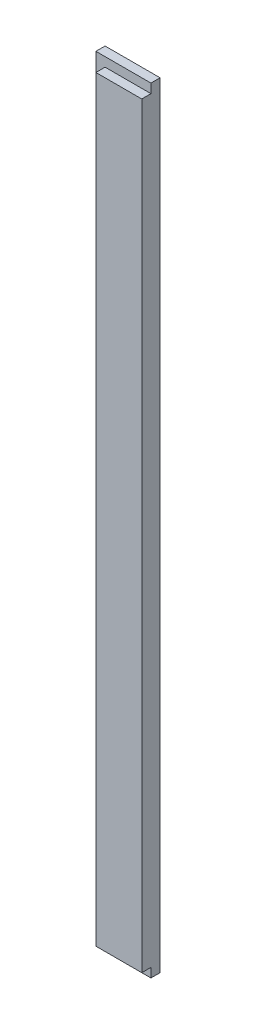
ISO-10303-21;
HEADER;
FILE_DESCRIPTION(('STEP AP214'),'2;1');
FILE_NAME('part.step','',(''),(''),'','','');
FILE_SCHEMA(('AUTOMOTIVE_DESIGN { 1 0 10303 214 1 1 1 1 }'));
ENDSEC;
DATA;
#1=APPLICATION_CONTEXT('core data for automotive mechanical design processes');
#2=APPLICATION_PROTOCOL_DEFINITION('international standard','automotive_design',2000,#1);
#3=PRODUCT_CONTEXT('',#1,'mechanical');
#4=PRODUCT('Part','Part','',(#3));
#5=PRODUCT_RELATED_PRODUCT_CATEGORY('part','',(#4));
#6=PRODUCT_DEFINITION_FORMATION('','',#4);
#7=PRODUCT_DEFINITION_CONTEXT('part definition',#1,'design');
#8=PRODUCT_DEFINITION('design','',#6,#7);
#9=PRODUCT_DEFINITION_SHAPE('','',#8);
#10=(LENGTH_UNIT() NAMED_UNIT(*) SI_UNIT(.MILLI.,.METRE.));
#11=(NAMED_UNIT(*) PLANE_ANGLE_UNIT() SI_UNIT($,.RADIAN.));
#12=(NAMED_UNIT(*) SI_UNIT($,.STERADIAN.) SOLID_ANGLE_UNIT());
#13=UNCERTAINTY_MEASURE_WITH_UNIT(LENGTH_MEASURE(1.E-05),#10,'distance_accuracy_value','');
#14=(GEOMETRIC_REPRESENTATION_CONTEXT(3) GLOBAL_UNCERTAINTY_ASSIGNED_CONTEXT((#13)) GLOBAL_UNIT_ASSIGNED_CONTEXT((#10,
#11,#12)) REPRESENTATION_CONTEXT('',''));
#15=CARTESIAN_POINT('',(0.,0.,0.));
#16=DIRECTION('',(0.,0.,1.));
#17=DIRECTION('',(1.,0.,0.));
#18=AXIS2_PLACEMENT_3D('',#15,#16,#17);
#19=CARTESIAN_POINT('',(-30.0000000000001,-422.5,20.));
#20=DIRECTION('',(1.,0.,0.));
#21=DIRECTION('',(0.,0.,-1.));
#22=AXIS2_PLACEMENT_3D('',#19,#20,#21);
#23=PLANE('',#22);
#24=DIRECTION('',(0.,-1.,0.));
#25=VECTOR('',#24,1.);
#26=CARTESIAN_POINT('',(-30.0000000000001,422.5,10.));
#27=LINE('',#26,#25);
#28=CARTESIAN_POINT('',(-30.0000000000001,422.5,10.));
#29=VERTEX_POINT('',#28);
#30=CARTESIAN_POINT('',(-30.0000000000001,-422.5,10.));
#31=VERTEX_POINT('',#30);
#32=EDGE_CURVE('E104',#29,#31,#27,.T.);
#33=ORIENTED_EDGE('',*,*,#32,.F.);
#34=DIRECTION('',(0.,0.,-1.));
#35=VECTOR('',#34,1.);
#36=CARTESIAN_POINT('',(-30.0000000000001,422.5,20.));
#37=LINE('',#36,#35);
#38=CARTESIAN_POINT('',(-30.0000000000001,422.5,0.));
#39=VERTEX_POINT('',#38);
#40=EDGE_CURVE('E59',#29,#39,#37,.T.);
#41=ORIENTED_EDGE('',*,*,#40,.T.);
#42=DIRECTION('',(0.,-1.,0.));
#43=VECTOR('',#42,1.);
#44=CARTESIAN_POINT('',(-30.0000000000001,-422.5,0.));
#45=LINE('',#44,#43);
#46=CARTESIAN_POINT('',(-30.0000000000001,-422.5,0.));
#47=VERTEX_POINT('',#46);
#48=EDGE_CURVE('E144',#39,#47,#45,.T.);
#49=ORIENTED_EDGE('',*,*,#48,.T.);
#50=DIRECTION('',(0.,0.,-1.));
#51=VECTOR('',#50,1.);
#52=CARTESIAN_POINT('',(-30.0000000000001,-422.5,20.));
#53=LINE('',#52,#51);
#54=EDGE_CURVE('E11',#31,#47,#53,.T.);
#55=ORIENTED_EDGE('',*,*,#54,.F.);
#56=EDGE_LOOP('',(#33,#41,#49,#55));
#57=FACE_BOUND('',#56,.T.);
#58=ADVANCED_FACE('F37',(#57),#23,.F.);
#59=CARTESIAN_POINT('',(30.0000000000001,-422.5,20.));
#60=DIRECTION('',(0.,1.,0.));
#61=DIRECTION('',(0.,0.,1.));
#62=AXIS2_PLACEMENT_3D('',#59,#60,#61);
#63=PLANE('',#62);
#64=DIRECTION('',(1.,0.,0.));
#65=VECTOR('',#64,1.);
#66=CARTESIAN_POINT('',(-30.0000000000001,-422.5,10.));
#67=LINE('',#66,#65);
#68=CARTESIAN_POINT('',(30.0000000000001,-422.5,10.));
#69=VERTEX_POINT('',#68);
#70=EDGE_CURVE('E114',#31,#69,#67,.T.);
#71=ORIENTED_EDGE('',*,*,#70,.F.);
#72=ORIENTED_EDGE('',*,*,#54,.T.);
#73=DIRECTION('',(1.,0.,0.));
#74=VECTOR('',#73,1.);
#75=CARTESIAN_POINT('',(30.0000000000001,-422.5,0.));
#76=LINE('',#75,#74);
#77=CARTESIAN_POINT('',(30.0000000000001,-422.5,0.));
#78=VERTEX_POINT('',#77);
#79=EDGE_CURVE('E141',#47,#78,#76,.T.);
#80=ORIENTED_EDGE('',*,*,#79,.T.);
#81=DIRECTION('',(0.,0.,-1.));
#82=VECTOR('',#81,1.);
#83=CARTESIAN_POINT('',(30.0000000000001,-422.5,20.));
#84=LINE('',#83,#82);
#85=EDGE_CURVE('E44',#69,#78,#84,.T.);
#86=ORIENTED_EDGE('',*,*,#85,.F.);
#87=EDGE_LOOP('',(#71,#72,#80,#86));
#88=FACE_BOUND('',#87,.T.);
#89=ADVANCED_FACE('F142',(#88),#63,.F.);
#90=CARTESIAN_POINT('',(-30.0000000000001,422.5,20.));
#91=DIRECTION('',(0.,-1.,0.));
#92=DIRECTION('',(0.,0.,-1.));
#93=AXIS2_PLACEMENT_3D('',#90,#91,#92);
#94=PLANE('',#93);
#95=DIRECTION('',(-1.,0.,0.));
#96=VECTOR('',#95,1.);
#97=CARTESIAN_POINT('',(30.0000000000001,422.5,10.));
#98=LINE('',#97,#96);
#99=CARTESIAN_POINT('',(30.0000000000001,422.5,10.));
#100=VERTEX_POINT('',#99);
#101=EDGE_CURVE('E102',#100,#29,#98,.T.);
#102=ORIENTED_EDGE('',*,*,#101,.F.);
#103=DIRECTION('',(0.,0.,-1.));
#104=VECTOR('',#103,1.);
#105=CARTESIAN_POINT('',(30.0000000000001,422.5,20.));
#106=LINE('',#105,#104);
#107=CARTESIAN_POINT('',(30.0000000000001,422.5,0.));
#108=VERTEX_POINT('',#107);
#109=EDGE_CURVE('E120',#100,#108,#106,.T.);
#110=ORIENTED_EDGE('',*,*,#109,.T.);
#111=DIRECTION('',(-1.,0.,0.));
#112=VECTOR('',#111,1.);
#113=CARTESIAN_POINT('',(-30.0000000000001,422.5,0.));
#114=LINE('',#113,#112);
#115=EDGE_CURVE('E118',#108,#39,#114,.T.);
#116=ORIENTED_EDGE('',*,*,#115,.T.);
#117=ORIENTED_EDGE('',*,*,#40,.F.);
#118=EDGE_LOOP('',(#102,#110,#116,#117));
#119=FACE_BOUND('',#118,.T.);
#120=ADVANCED_FACE('F116',(#119),#94,.F.);
#121=CARTESIAN_POINT('',(30.0000000000001,422.5,20.));
#122=DIRECTION('',(-1.,0.,0.));
#123=DIRECTION('',(0.,0.,1.));
#124=AXIS2_PLACEMENT_3D('',#121,#122,#123);
#125=PLANE('',#124);
#126=DIRECTION('',(0.,1.,0.));
#127=VECTOR('',#126,1.);
#128=CARTESIAN_POINT('',(30.0000000000001,422.5,20.));
#129=LINE('',#128,#127);
#130=CARTESIAN_POINT('',(30.0000000000001,-412.5,20.));
#131=VERTEX_POINT('',#130);
#132=CARTESIAN_POINT('',(30.0000000000001,412.5,20.));
#133=VERTEX_POINT('',#132);
#134=EDGE_CURVE('E121',#131,#133,#129,.T.);
#135=ORIENTED_EDGE('',*,*,#134,.F.);
#136=DIRECTION('',(0.,0.,1.));
#137=VECTOR('',#136,1.);
#138=CARTESIAN_POINT('',(30.0000000000001,-412.5,10.));
#139=LINE('',#138,#137);
#140=CARTESIAN_POINT('',(30.0000000000001,-412.5,10.));
#141=VERTEX_POINT('',#140);
#142=EDGE_CURVE('E51',#141,#131,#139,.T.);
#143=ORIENTED_EDGE('',*,*,#142,.F.);
#144=DIRECTION('',(0.,1.,0.));
#145=VECTOR('',#144,1.);
#146=CARTESIAN_POINT('',(30.0000000000001,-422.5,10.));
#147=LINE('',#146,#145);
#148=EDGE_CURVE('E138',#69,#141,#147,.T.);
#149=ORIENTED_EDGE('',*,*,#148,.F.);
#150=ORIENTED_EDGE('',*,*,#85,.T.);
#151=DIRECTION('',(0.,1.,0.));
#152=VECTOR('',#151,1.);
#153=CARTESIAN_POINT('',(30.0000000000001,422.5,0.));
#154=LINE('',#153,#152);
#155=EDGE_CURVE('E136',#78,#108,#154,.T.);
#156=ORIENTED_EDGE('',*,*,#155,.T.);
#157=ORIENTED_EDGE('',*,*,#109,.F.);
#158=DIRECTION('',(0.,1.,0.));
#159=VECTOR('',#158,1.);
#160=CARTESIAN_POINT('',(30.0000000000001,412.5,10.));
#161=LINE('',#160,#159);
#162=CARTESIAN_POINT('',(30.0000000000001,412.5,10.));
#163=VERTEX_POINT('',#162);
#164=EDGE_CURVE('E108',#163,#100,#161,.T.);
#165=ORIENTED_EDGE('',*,*,#164,.F.);
#166=DIRECTION('',(0.,0.,1.));
#167=VECTOR('',#166,1.);
#168=CARTESIAN_POINT('',(30.0000000000001,412.5,10.));
#169=LINE('',#168,#167);
#170=EDGE_CURVE('E148',#163,#133,#169,.T.);
#171=ORIENTED_EDGE('',*,*,#170,.T.);
#172=EDGE_LOOP('',(#135,#143,#149,#150,#156,#157,#165,#171));
#173=FACE_BOUND('',#172,.T.);
#174=ADVANCED_FACE('F134',(#173),#125,.F.);
#175=CARTESIAN_POINT('',(0.,0.,20.));
#176=DIRECTION('',(0.,0.,-1.));
#177=DIRECTION('',(-1.,0.,0.));
#178=AXIS2_PLACEMENT_3D('',#175,#176,#177);
#179=PLANE('',#178);
#180=ORIENTED_EDGE('',*,*,#134,.T.);
#181=DIRECTION('',(1.,0.,0.));
#182=VECTOR('',#181,1.);
#183=CARTESIAN_POINT('',(30.0000000000001,412.5,20.));
#184=LINE('',#183,#182);
#185=CARTESIAN_POINT('',(-20.0000000000001,412.5,20.));
#186=VERTEX_POINT('',#185);
#187=EDGE_CURVE('E111',#186,#133,#184,.T.);
#188=ORIENTED_EDGE('',*,*,#187,.F.);
#189=DIRECTION('',(0.,1.,0.));
#190=VECTOR('',#189,1.);
#191=CARTESIAN_POINT('',(-20.0000000000001,412.5,20.));
#192=LINE('',#191,#190);
#193=CARTESIAN_POINT('',(-20.,-412.5,20.));
#194=VERTEX_POINT('',#193);
#195=EDGE_CURVE('E158',#194,#186,#192,.T.);
#196=ORIENTED_EDGE('',*,*,#195,.F.);
#197=DIRECTION('',(-1.,0.,0.));
#198=VECTOR('',#197,1.);
#199=CARTESIAN_POINT('',(-20.,-412.5,20.));
#200=LINE('',#199,#198);
#201=EDGE_CURVE('E161',#131,#194,#200,.T.);
#202=ORIENTED_EDGE('',*,*,#201,.F.);
#203=EDGE_LOOP('',(#180,#188,#196,#202));
#204=FACE_BOUND('',#203,.T.);
#205=ADVANCED_FACE('F175',(#204),#179,.F.);
#206=CARTESIAN_POINT('',(0.,0.,0.));
#207=DIRECTION('',(0.,0.,-1.));
#208=DIRECTION('',(-1.,0.,0.));
#209=AXIS2_PLACEMENT_3D('',#206,#207,#208);
#210=PLANE('',#209);
#211=ORIENTED_EDGE('',*,*,#48,.F.);
#212=ORIENTED_EDGE('',*,*,#115,.F.);
#213=ORIENTED_EDGE('',*,*,#155,.F.);
#214=ORIENTED_EDGE('',*,*,#79,.F.);
#215=EDGE_LOOP('',(#211,#212,#213,#214));
#216=FACE_BOUND('',#215,.T.);
#217=ADVANCED_FACE('F146',(#216),#210,.T.);
#218=CARTESIAN_POINT('',(30.0000000000001,412.5,10.));
#219=DIRECTION('',(0.,-1.,0.));
#220=DIRECTION('',(0.,0.,-1.));
#221=AXIS2_PLACEMENT_3D('',#218,#219,#220);
#222=PLANE('',#221);
#223=ORIENTED_EDGE('',*,*,#187,.T.);
#224=ORIENTED_EDGE('',*,*,#170,.F.);
#225=DIRECTION('',(1.,0.,0.));
#226=VECTOR('',#225,1.);
#227=CARTESIAN_POINT('',(30.0000000000001,412.5,10.));
#228=LINE('',#227,#226);
#229=CARTESIAN_POINT('',(-20.0000000000001,412.5,10.));
#230=VERTEX_POINT('',#229);
#231=EDGE_CURVE('E164',#230,#163,#228,.T.);
#232=ORIENTED_EDGE('',*,*,#231,.F.);
#233=DIRECTION('',(0.,0.,1.));
#234=VECTOR('',#233,1.);
#235=CARTESIAN_POINT('',(-20.0000000000001,412.5,10.));
#236=LINE('',#235,#234);
#237=EDGE_CURVE('E153',#230,#186,#236,.T.);
#238=ORIENTED_EDGE('',*,*,#237,.T.);
#239=EDGE_LOOP('',(#223,#224,#232,#238));
#240=FACE_BOUND('',#239,.T.);
#241=ADVANCED_FACE('F183',(#240),#222,.F.);
#242=CARTESIAN_POINT('',(-20.0000000000001,412.5,10.));
#243=DIRECTION('',(1.,0.,0.));
#244=DIRECTION('',(0.,1.,0.));
#245=AXIS2_PLACEMENT_3D('',#242,#243,#244);
#246=PLANE('',#245);
#247=ORIENTED_EDGE('',*,*,#195,.T.);
#248=ORIENTED_EDGE('',*,*,#237,.F.);
#249=DIRECTION('',(0.,1.,0.));
#250=VECTOR('',#249,1.);
#251=CARTESIAN_POINT('',(-20.0000000000001,412.5,10.));
#252=LINE('',#251,#250);
#253=CARTESIAN_POINT('',(-20.,-412.5,10.));
#254=VERTEX_POINT('',#253);
#255=EDGE_CURVE('E166',#254,#230,#252,.T.);
#256=ORIENTED_EDGE('',*,*,#255,.F.);
#257=DIRECTION('',(0.,0.,1.));
#258=VECTOR('',#257,1.);
#259=CARTESIAN_POINT('',(-20.,-412.5,10.));
#260=LINE('',#259,#258);
#261=EDGE_CURVE('E151',#254,#194,#260,.T.);
#262=ORIENTED_EDGE('',*,*,#261,.T.);
#263=EDGE_LOOP('',(#247,#248,#256,#262));
#264=FACE_BOUND('',#263,.T.);
#265=ADVANCED_FACE('F180',(#264),#246,.F.);
#266=CARTESIAN_POINT('',(-20.,-412.5,10.));
#267=DIRECTION('',(0.,1.,0.));
#268=DIRECTION('',(0.,0.,1.));
#269=AXIS2_PLACEMENT_3D('',#266,#267,#268);
#270=PLANE('',#269);
#271=ORIENTED_EDGE('',*,*,#201,.T.);
#272=ORIENTED_EDGE('',*,*,#261,.F.);
#273=DIRECTION('',(-1.,0.,0.));
#274=VECTOR('',#273,1.);
#275=CARTESIAN_POINT('',(-20.,-412.5,10.));
#276=LINE('',#275,#274);
#277=EDGE_CURVE('E169',#141,#254,#276,.T.);
#278=ORIENTED_EDGE('',*,*,#277,.F.);
#279=ORIENTED_EDGE('',*,*,#142,.T.);
#280=EDGE_LOOP('',(#271,#272,#278,#279));
#281=FACE_BOUND('',#280,.T.);
#282=ADVANCED_FACE('F177',(#281),#270,.F.);
#283=CARTESIAN_POINT('',(0.,0.,10.));
#284=DIRECTION('',(0.,0.,1.));
#285=DIRECTION('',(1.,0.,0.));
#286=AXIS2_PLACEMENT_3D('',#283,#284,#285);
#287=PLANE('',#286);
#288=ORIENTED_EDGE('',*,*,#101,.T.);
#289=ORIENTED_EDGE('',*,*,#32,.T.);
#290=ORIENTED_EDGE('',*,*,#70,.T.);
#291=ORIENTED_EDGE('',*,*,#148,.T.);
#292=ORIENTED_EDGE('',*,*,#277,.T.);
#293=ORIENTED_EDGE('',*,*,#255,.T.);
#294=ORIENTED_EDGE('',*,*,#231,.T.);
#295=ORIENTED_EDGE('',*,*,#164,.T.);
#296=EDGE_LOOP('',(#288,#289,#290,#291,#292,#293,#294,#295));
#297=FACE_BOUND('',#296,.T.);
#298=ADVANCED_FACE('F103',(#297),#287,.T.);
#299=CLOSED_SHELL('',(#58,#89,#120,#174,#205,#217,#241,#265,#282,#298));
#300=MANIFOLD_SOLID_BREP('B2',#299);
#301=ADVANCED_BREP_SHAPE_REPRESENTATION('',(#18,#300),#14);
#302=SHAPE_DEFINITION_REPRESENTATION(#9,#301);
ENDSEC;
END-ISO-10303-21;
